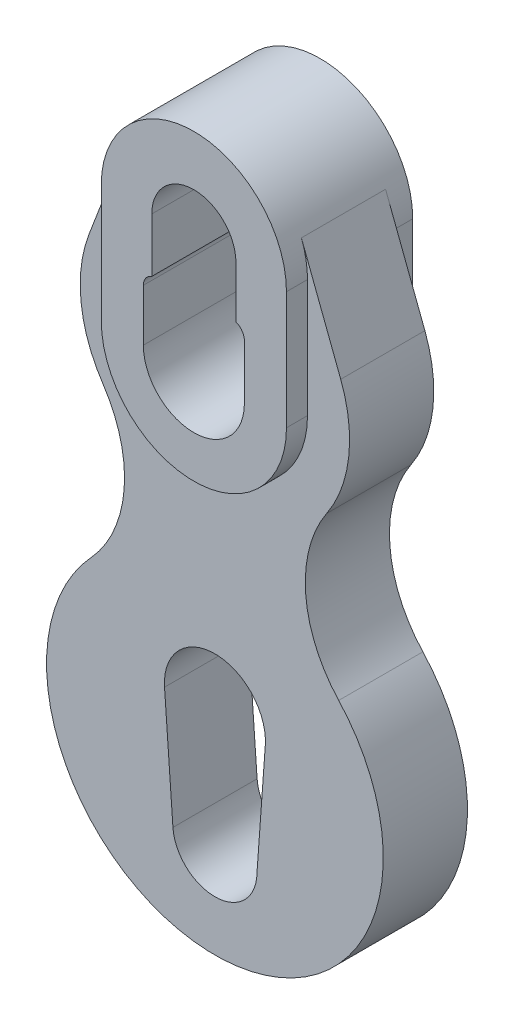
ISO-10303-21;
HEADER;
FILE_DESCRIPTION(('STEP AP214'),'2;1');
FILE_NAME('part.step','',(''),(''),'','','');
FILE_SCHEMA(('AUTOMOTIVE_DESIGN { 1 0 10303 214 1 1 1 1 }'));
ENDSEC;
DATA;
#1=APPLICATION_CONTEXT('core data for automotive mechanical design processes');
#2=APPLICATION_PROTOCOL_DEFINITION('international standard','automotive_design',2000,#1);
#3=PRODUCT_CONTEXT('',#1,'mechanical');
#4=PRODUCT('Part','Part','',(#3));
#5=PRODUCT_RELATED_PRODUCT_CATEGORY('part','',(#4));
#6=PRODUCT_DEFINITION_FORMATION('','',#4);
#7=PRODUCT_DEFINITION_CONTEXT('part definition',#1,'design');
#8=PRODUCT_DEFINITION('design','',#6,#7);
#9=PRODUCT_DEFINITION_SHAPE('','',#8);
#10=(LENGTH_UNIT() NAMED_UNIT(*) SI_UNIT(.MILLI.,.METRE.));
#11=(NAMED_UNIT(*) PLANE_ANGLE_UNIT() SI_UNIT($,.RADIAN.));
#12=(NAMED_UNIT(*) SI_UNIT($,.STERADIAN.) SOLID_ANGLE_UNIT());
#13=UNCERTAINTY_MEASURE_WITH_UNIT(LENGTH_MEASURE(1.E-05),#10,'distance_accuracy_value','');
#14=(GEOMETRIC_REPRESENTATION_CONTEXT(3) GLOBAL_UNCERTAINTY_ASSIGNED_CONTEXT((#13)) GLOBAL_UNIT_ASSIGNED_CONTEXT((#10,
#11,#12)) REPRESENTATION_CONTEXT('',''));
#15=CARTESIAN_POINT('',(0.,0.,0.));
#16=DIRECTION('',(0.,0.,1.));
#17=DIRECTION('',(1.,0.,0.));
#18=AXIS2_PLACEMENT_3D('',#15,#16,#17);
#19=CARTESIAN_POINT('',(-22.,0.,15.));
#20=DIRECTION('',(1.,0.,0.));
#21=DIRECTION('',(0.,1.,0.));
#22=AXIS2_PLACEMENT_3D('',#19,#20,#21);
#23=PLANE('',#22);
#24=DIRECTION('',(0.,-1.,0.));
#25=VECTOR('',#24,1.);
#26=CARTESIAN_POINT('',(-22.,0.,-10.));
#27=LINE('',#26,#25);
#28=CARTESIAN_POINT('',(-22.,110.,-10.));
#29=VERTEX_POINT('',#28);
#30=CARTESIAN_POINT('',(-22.,82.,-10.));
#31=VERTEX_POINT('',#30);
#32=EDGE_CURVE('E299',#29,#31,#27,.T.);
#33=ORIENTED_EDGE('',*,*,#32,.F.);
#34=DIRECTION('',(0.,0.,-1.));
#35=VECTOR('',#34,1.);
#36=CARTESIAN_POINT('',(-22.,110.,15.));
#37=LINE('',#36,#35);
#38=CARTESIAN_POINT('',(-22.,110.,-15.));
#39=VERTEX_POINT('',#38);
#40=EDGE_CURVE('E374',#29,#39,#37,.T.);
#41=ORIENTED_EDGE('',*,*,#40,.T.);
#42=DIRECTION('',(0.,-1.,0.));
#43=VECTOR('',#42,1.);
#44=CARTESIAN_POINT('',(-22.,0.,-15.));
#45=LINE('',#44,#43);
#46=CARTESIAN_POINT('',(-22.,82.,-15.));
#47=VERTEX_POINT('',#46);
#48=EDGE_CURVE('E324',#39,#47,#45,.T.);
#49=ORIENTED_EDGE('',*,*,#48,.T.);
#50=DIRECTION('',(0.,0.,-1.));
#51=VECTOR('',#50,1.);
#52=CARTESIAN_POINT('',(-22.,82.,15.));
#53=LINE('',#52,#51);
#54=EDGE_CURVE('E430',#31,#47,#53,.T.);
#55=ORIENTED_EDGE('',*,*,#54,.F.);
#56=EDGE_LOOP('',(#33,#41,#49,#55));
#57=FACE_BOUND('',#56,.T.);
#58=ADVANCED_FACE('F35',(#57),#23,.F.);
#59=CARTESIAN_POINT('',(0.,82.,15.));
#60=DIRECTION('',(0.,0.,-1.));
#61=DIRECTION('',(-1.,0.,0.));
#62=AXIS2_PLACEMENT_3D('',#59,#60,#61);
#63=CYLINDRICAL_SURFACE('',#62,22.);
#64=CARTESIAN_POINT('',(0.,82.,-10.));
#65=DIRECTION('',(0.,0.,1.));
#66=DIRECTION('',(1.,0.,0.));
#67=AXIS2_PLACEMENT_3D('',#64,#65,#66);
#68=CIRCLE('',#67,22.);
#69=CARTESIAN_POINT('',(22.,82.,-10.));
#70=VERTEX_POINT('',#69);
#71=EDGE_CURVE('E52',#31,#70,#68,.T.);
#72=ORIENTED_EDGE('',*,*,#71,.F.);
#73=ORIENTED_EDGE('',*,*,#54,.T.);
#74=CARTESIAN_POINT('',(0.,82.,-15.));
#75=DIRECTION('',(0.,0.,1.));
#76=DIRECTION('',(1.,0.,0.));
#77=AXIS2_PLACEMENT_3D('',#74,#75,#76);
#78=CIRCLE('',#77,22.);
#79=CARTESIAN_POINT('',(22.,82.,-15.));
#80=VERTEX_POINT('',#79);
#81=EDGE_CURVE('E377',#47,#80,#78,.T.);
#82=ORIENTED_EDGE('',*,*,#81,.T.);
#83=DIRECTION('',(0.,0.,-1.));
#84=VECTOR('',#83,1.);
#85=CARTESIAN_POINT('',(22.,82.,15.));
#86=LINE('',#85,#84);
#87=EDGE_CURVE('E427',#70,#80,#86,.T.);
#88=ORIENTED_EDGE('',*,*,#87,.F.);
#89=EDGE_LOOP('',(#72,#73,#82,#88));
#90=FACE_BOUND('',#89,.T.);
#91=ADVANCED_FACE('F439',(#90),#63,.T.);
#92=CARTESIAN_POINT('',(22.,0.,15.));
#93=DIRECTION('',(1.,0.,0.));
#94=DIRECTION('',(0.,1.,0.));
#95=AXIS2_PLACEMENT_3D('',#92,#93,#94);
#96=PLANE('',#95);
#97=DIRECTION('',(0.,0.,-1.));
#98=VECTOR('',#97,1.);
#99=CARTESIAN_POINT('',(22.,110.,15.));
#100=LINE('',#99,#98);
#101=CARTESIAN_POINT('',(22.,110.,-10.));
#102=VERTEX_POINT('',#101);
#103=CARTESIAN_POINT('',(22.,110.,-15.));
#104=VERTEX_POINT('',#103);
#105=EDGE_CURVE('E424',#102,#104,#100,.T.);
#106=ORIENTED_EDGE('',*,*,#105,.F.);
#107=DIRECTION('',(0.,-1.,0.));
#108=VECTOR('',#107,1.);
#109=CARTESIAN_POINT('',(22.,0.,-10.));
#110=LINE('',#109,#108);
#111=EDGE_CURVE('E295',#102,#70,#110,.T.);
#112=ORIENTED_EDGE('',*,*,#111,.T.);
#113=ORIENTED_EDGE('',*,*,#87,.T.);
#114=DIRECTION('',(0.,-1.,0.));
#115=VECTOR('',#114,1.);
#116=CARTESIAN_POINT('',(22.,0.,-15.));
#117=LINE('',#116,#115);
#118=EDGE_CURVE('E380',#104,#80,#117,.T.);
#119=ORIENTED_EDGE('',*,*,#118,.F.);
#120=EDGE_LOOP('',(#106,#112,#113,#119));
#121=FACE_BOUND('',#120,.T.);
#122=ADVANCED_FACE('F436',(#121),#96,.T.);
#123=CARTESIAN_POINT('',(9.99999999999998,0.,15.));
#124=DIRECTION('',(1.,0.,0.));
#125=DIRECTION('',(0.,1.,0.));
#126=AXIS2_PLACEMENT_3D('',#123,#124,#125);
#127=PLANE('',#126);
#128=DIRECTION('',(0.,-1.,0.));
#129=VECTOR('',#128,1.);
#130=CARTESIAN_POINT('',(9.99999999999998,0.,-15.));
#131=LINE('',#130,#129);
#132=CARTESIAN_POINT('',(10.,110.,-15.));
#133=VERTEX_POINT('',#132);
#134=CARTESIAN_POINT('',(10.,97.7630843631491,-15.));
#135=VERTEX_POINT('',#134);
#136=EDGE_CURVE('E386',#133,#135,#131,.T.);
#137=ORIENTED_EDGE('',*,*,#136,.T.);
#138=DIRECTION('',(0.,0.,-1.));
#139=VECTOR('',#138,1.);
#140=CARTESIAN_POINT('',(10.,97.7630843631491,15.));
#141=LINE('',#140,#139);
#142=CARTESIAN_POINT('',(10.,97.7630843631491,15.));
#143=VERTEX_POINT('',#142);
#144=EDGE_CURVE('E11',#143,#135,#141,.T.);
#145=ORIENTED_EDGE('',*,*,#144,.F.);
#146=DIRECTION('',(0.,-1.,0.));
#147=VECTOR('',#146,1.);
#148=CARTESIAN_POINT('',(9.99999999999998,0.,15.));
#149=LINE('',#148,#147);
#150=CARTESIAN_POINT('',(10.,110.,15.));
#151=VERTEX_POINT('',#150);
#152=EDGE_CURVE('E352',#151,#143,#149,.T.);
#153=ORIENTED_EDGE('',*,*,#152,.F.);
#154=DIRECTION('',(0.,0.,-1.));
#155=VECTOR('',#154,1.);
#156=CARTESIAN_POINT('',(10.,110.,15.));
#157=LINE('',#156,#155);
#158=EDGE_CURVE('E408',#151,#133,#157,.T.);
#159=ORIENTED_EDGE('',*,*,#158,.T.);
#160=EDGE_LOOP('',(#137,#145,#153,#159));
#161=FACE_BOUND('',#160,.T.);
#162=ADVANCED_FACE('F541',(#161),#127,.F.);
#163=CARTESIAN_POINT('',(9.00000000000001,94.9346572384029,15.));
#164=DIRECTION('',(0.,0.,-1.));
#165=DIRECTION('',(-1.,0.,0.));
#166=AXIS2_PLACEMENT_3D('',#163,#164,#165);
#167=CYLINDRICAL_SURFACE('',#166,3.);
#168=CARTESIAN_POINT('',(9.00000000000001,94.9346572384029,-15.));
#169=DIRECTION('',(0.,0.,1.));
#170=DIRECTION('',(1.,0.,0.));
#171=AXIS2_PLACEMENT_3D('',#168,#169,#170);
#172=CIRCLE('',#171,3.);
#173=CARTESIAN_POINT('',(12.,94.9346572384029,-15.));
#174=VERTEX_POINT('',#173);
#175=EDGE_CURVE('E389',#135,#174,#172,.F.);
#176=ORIENTED_EDGE('',*,*,#175,.T.);
#177=DIRECTION('',(0.,0.,-1.));
#178=VECTOR('',#177,1.);
#179=CARTESIAN_POINT('',(12.,94.9346572384029,15.));
#180=LINE('',#179,#178);
#181=CARTESIAN_POINT('',(12.,94.9346572384029,15.));
#182=VERTEX_POINT('',#181);
#183=EDGE_CURVE('E44',#182,#174,#180,.T.);
#184=ORIENTED_EDGE('',*,*,#183,.F.);
#185=CARTESIAN_POINT('',(9.00000000000001,94.9346572384029,15.));
#186=DIRECTION('',(0.,0.,1.));
#187=DIRECTION('',(1.,0.,0.));
#188=AXIS2_PLACEMENT_3D('',#185,#186,#187);
#189=CIRCLE('',#188,3.);
#190=EDGE_CURVE('E355',#143,#182,#189,.F.);
#191=ORIENTED_EDGE('',*,*,#190,.F.);
#192=ORIENTED_EDGE('',*,*,#144,.T.);
#193=EDGE_LOOP('',(#176,#184,#191,#192));
#194=FACE_BOUND('',#193,.T.);
#195=ADVANCED_FACE('F537',(#194),#167,.F.);
#196=CARTESIAN_POINT('',(12.0000000000001,0.,15.));
#197=DIRECTION('',(1.,0.,0.));
#198=DIRECTION('',(0.,1.,0.));
#199=AXIS2_PLACEMENT_3D('',#196,#197,#198);
#200=PLANE('',#199);
#201=DIRECTION('',(0.,-1.,0.));
#202=VECTOR('',#201,1.);
#203=CARTESIAN_POINT('',(12.0000000000001,0.,-15.));
#204=LINE('',#203,#202);
#205=CARTESIAN_POINT('',(12.,82.,-15.));
#206=VERTEX_POINT('',#205);
#207=EDGE_CURVE('E391',#174,#206,#204,.T.);
#208=ORIENTED_EDGE('',*,*,#207,.T.);
#209=DIRECTION('',(0.,0.,-1.));
#210=VECTOR('',#209,1.);
#211=CARTESIAN_POINT('',(12.,82.,15.));
#212=LINE('',#211,#210);
#213=CARTESIAN_POINT('',(12.,82.,15.));
#214=VERTEX_POINT('',#213);
#215=EDGE_CURVE('E418',#214,#206,#212,.T.);
#216=ORIENTED_EDGE('',*,*,#215,.F.);
#217=DIRECTION('',(0.,-1.,0.));
#218=VECTOR('',#217,1.);
#219=CARTESIAN_POINT('',(12.0000000000001,0.,15.));
#220=LINE('',#219,#218);
#221=EDGE_CURVE('E357',#182,#214,#220,.T.);
#222=ORIENTED_EDGE('',*,*,#221,.F.);
#223=ORIENTED_EDGE('',*,*,#183,.T.);
#224=EDGE_LOOP('',(#208,#216,#222,#223));
#225=FACE_BOUND('',#224,.T.);
#226=ADVANCED_FACE('F533',(#225),#200,.F.);
#227=CARTESIAN_POINT('',(0.,82.,15.));
#228=DIRECTION('',(0.,0.,-1.));
#229=DIRECTION('',(-1.,0.,0.));
#230=AXIS2_PLACEMENT_3D('',#227,#228,#229);
#231=CYLINDRICAL_SURFACE('',#230,12.0000000000003);
#232=CARTESIAN_POINT('',(0.,82.,-15.));
#233=DIRECTION('',(0.,0.,1.));
#234=DIRECTION('',(1.,0.,0.));
#235=AXIS2_PLACEMENT_3D('',#232,#233,#234);
#236=CIRCLE('',#235,12.0000000000003);
#237=CARTESIAN_POINT('',(-12.0000000000006,81.9999999999999,-15.));
#238=VERTEX_POINT('',#237);
#239=EDGE_CURVE('E394',#238,#206,#236,.T.);
#240=ORIENTED_EDGE('',*,*,#239,.F.);
#241=DIRECTION('',(0.,0.,-1.));
#242=VECTOR('',#241,1.);
#243=CARTESIAN_POINT('',(-12.0000000000006,81.9999999999999,15.));
#244=LINE('',#243,#242);
#245=CARTESIAN_POINT('',(-12.0000000000006,81.9999999999999,15.));
#246=VERTEX_POINT('',#245);
#247=EDGE_CURVE('E416',#246,#238,#244,.T.);
#248=ORIENTED_EDGE('',*,*,#247,.F.);
#249=CARTESIAN_POINT('',(0.,82.,15.));
#250=DIRECTION('',(0.,0.,1.));
#251=DIRECTION('',(1.,0.,0.));
#252=AXIS2_PLACEMENT_3D('',#249,#250,#251);
#253=CIRCLE('',#252,12.0000000000003);
#254=EDGE_CURVE('E359',#246,#214,#253,.T.);
#255=ORIENTED_EDGE('',*,*,#254,.T.);
#256=ORIENTED_EDGE('',*,*,#215,.T.);
#257=EDGE_LOOP('',(#240,#248,#255,#256));
#258=FACE_BOUND('',#257,.T.);
#259=ADVANCED_FACE('F529',(#258),#231,.F.);
#260=CARTESIAN_POINT('',(-12.0000000000044,5.54110435051287E-13,15.));
#261=DIRECTION('',(1.,0.,0.));
#262=DIRECTION('',(0.,1.,0.));
#263=AXIS2_PLACEMENT_3D('',#260,#261,#262);
#264=PLANE('',#263);
#265=DIRECTION('',(0.,-1.,0.));
#266=VECTOR('',#265,1.);
#267=CARTESIAN_POINT('',(-12.0000000000044,5.54110435051287E-13,-15.));
#268=LINE('',#267,#266);
#269=CARTESIAN_POINT('',(-12.,94.3222216539112,-15.));
#270=VERTEX_POINT('',#269);
#271=EDGE_CURVE('E397',#270,#238,#268,.T.);
#272=ORIENTED_EDGE('',*,*,#271,.F.);
#273=DIRECTION('',(0.,0.,-1.));
#274=VECTOR('',#273,1.);
#275=CARTESIAN_POINT('',(-12.,94.3222216539112,15.));
#276=LINE('',#275,#274);
#277=CARTESIAN_POINT('',(-12.,94.3222216539112,15.));
#278=VERTEX_POINT('',#277);
#279=EDGE_CURVE('E414',#278,#270,#276,.T.);
#280=ORIENTED_EDGE('',*,*,#279,.F.);
#281=DIRECTION('',(0.,-1.,0.));
#282=VECTOR('',#281,1.);
#283=CARTESIAN_POINT('',(-12.0000000000044,5.54110435051287E-13,15.));
#284=LINE('',#283,#282);
#285=EDGE_CURVE('E362',#278,#246,#284,.T.);
#286=ORIENTED_EDGE('',*,*,#285,.T.);
#287=ORIENTED_EDGE('',*,*,#247,.T.);
#288=EDGE_LOOP('',(#272,#280,#286,#287));
#289=FACE_BOUND('',#288,.T.);
#290=ADVANCED_FACE('F525',(#289),#264,.T.);
#291=CARTESIAN_POINT('',(-9.00000000000001,94.3222216539112,15.));
#292=DIRECTION('',(0.,0.,-1.));
#293=DIRECTION('',(-1.,0.,0.));
#294=AXIS2_PLACEMENT_3D('',#291,#292,#293);
#295=CYLINDRICAL_SURFACE('',#294,3.);
#296=CARTESIAN_POINT('',(-9.00000000000001,94.3222216539112,-15.));
#297=DIRECTION('',(0.,0.,1.));
#298=DIRECTION('',(1.,0.,0.));
#299=AXIS2_PLACEMENT_3D('',#296,#297,#298);
#300=CIRCLE('',#299,3.);
#301=CARTESIAN_POINT('',(-10.,97.1506487786574,-15.));
#302=VERTEX_POINT('',#301);
#303=EDGE_CURVE('E400',#302,#270,#300,.T.);
#304=ORIENTED_EDGE('',*,*,#303,.F.);
#305=DIRECTION('',(0.,0.,-1.));
#306=VECTOR('',#305,1.);
#307=CARTESIAN_POINT('',(-10.,97.1506487786574,15.));
#308=LINE('',#307,#306);
#309=CARTESIAN_POINT('',(-10.,97.1506487786574,15.));
#310=VERTEX_POINT('',#309);
#311=EDGE_CURVE('E412',#310,#302,#308,.T.);
#312=ORIENTED_EDGE('',*,*,#311,.F.);
#313=CARTESIAN_POINT('',(-9.00000000000001,94.3222216539112,15.));
#314=DIRECTION('',(0.,0.,1.));
#315=DIRECTION('',(1.,0.,0.));
#316=AXIS2_PLACEMENT_3D('',#313,#314,#315);
#317=CIRCLE('',#316,3.);
#318=EDGE_CURVE('E365',#310,#278,#317,.T.);
#319=ORIENTED_EDGE('',*,*,#318,.T.);
#320=ORIENTED_EDGE('',*,*,#279,.T.);
#321=EDGE_LOOP('',(#304,#312,#319,#320));
#322=FACE_BOUND('',#321,.T.);
#323=ADVANCED_FACE('F467',(#322),#295,.F.);
#324=CARTESIAN_POINT('',(-9.99999999999423,-5.94020909134747E-13,15.));
#325=DIRECTION('',(1.,0.,0.));
#326=DIRECTION('',(0.,1.,0.));
#327=AXIS2_PLACEMENT_3D('',#324,#325,#326);
#328=PLANE('',#327);
#329=DIRECTION('',(0.,-1.,0.));
#330=VECTOR('',#329,1.);
#331=CARTESIAN_POINT('',(-9.99999999999423,-5.94020909134747E-13,-15.));
#332=LINE('',#331,#330);
#333=CARTESIAN_POINT('',(-10.0000000000008,110.,-15.));
#334=VERTEX_POINT('',#333);
#335=EDGE_CURVE('E403',#334,#302,#332,.T.);
#336=ORIENTED_EDGE('',*,*,#335,.F.);
#337=DIRECTION('',(0.,0.,-1.));
#338=VECTOR('',#337,1.);
#339=CARTESIAN_POINT('',(-10.0000000000008,110.,15.));
#340=LINE('',#339,#338);
#341=CARTESIAN_POINT('',(-10.0000000000008,110.,15.));
#342=VERTEX_POINT('',#341);
#343=EDGE_CURVE('E410',#342,#334,#340,.T.);
#344=ORIENTED_EDGE('',*,*,#343,.F.);
#345=DIRECTION('',(0.,-1.,0.));
#346=VECTOR('',#345,1.);
#347=CARTESIAN_POINT('',(-9.99999999999423,-5.94020909134747E-13,15.));
#348=LINE('',#347,#346);
#349=EDGE_CURVE('E368',#342,#310,#348,.T.);
#350=ORIENTED_EDGE('',*,*,#349,.T.);
#351=ORIENTED_EDGE('',*,*,#311,.T.);
#352=EDGE_LOOP('',(#336,#344,#350,#351));
#353=FACE_BOUND('',#352,.T.);
#354=ADVANCED_FACE('F460',(#353),#328,.T.);
#355=CARTESIAN_POINT('',(-22.,110.,15.));
#356=VERTEX_POINT('',#355);
#357=CARTESIAN_POINT('',(-22.,110.,10.));
#358=VERTEX_POINT('',#357);
#359=EDGE_CURVE('E422',#356,#358,#37,.T.);
#360=ORIENTED_EDGE('',*,*,#359,.T.);
#361=DIRECTION('',(0.,-1.,0.));
#362=VECTOR('',#361,1.);
#363=CARTESIAN_POINT('',(-22.,0.,10.));
#364=LINE('',#363,#362);
#365=CARTESIAN_POINT('',(-22.,82.,10.));
#366=VERTEX_POINT('',#365);
#367=EDGE_CURVE('E60',#358,#366,#364,.T.);
#368=ORIENTED_EDGE('',*,*,#367,.T.);
#369=CARTESIAN_POINT('',(-22.,82.,15.));
#370=VERTEX_POINT('',#369);
#371=EDGE_CURVE('E39',#370,#366,#53,.T.);
#372=ORIENTED_EDGE('',*,*,#371,.F.);
#373=DIRECTION('',(0.,-1.,0.));
#374=VECTOR('',#373,1.);
#375=CARTESIAN_POINT('',(-22.,0.,15.));
#376=LINE('',#375,#374);
#377=EDGE_CURVE('E341',#356,#370,#376,.T.);
#378=ORIENTED_EDGE('',*,*,#377,.F.);
#379=EDGE_LOOP('',(#360,#368,#372,#378));
#380=FACE_BOUND('',#379,.T.);
#381=ADVANCED_FACE('F37',(#380),#23,.F.);
#382=ORIENTED_EDGE('',*,*,#371,.T.);
#383=CARTESIAN_POINT('',(0.,82.,10.));
#384=DIRECTION('',(0.,0.,1.));
#385=DIRECTION('',(1.,0.,0.));
#386=AXIS2_PLACEMENT_3D('',#383,#384,#385);
#387=CIRCLE('',#386,22.);
#388=CARTESIAN_POINT('',(22.,82.,10.));
#389=VERTEX_POINT('',#388);
#390=EDGE_CURVE('E265',#366,#389,#387,.T.);
#391=ORIENTED_EDGE('',*,*,#390,.T.);
#392=CARTESIAN_POINT('',(22.,82.,15.));
#393=VERTEX_POINT('',#392);
#394=EDGE_CURVE('E428',#393,#389,#86,.T.);
#395=ORIENTED_EDGE('',*,*,#394,.F.);
#396=CARTESIAN_POINT('',(0.,82.,15.));
#397=DIRECTION('',(0.,0.,1.));
#398=DIRECTION('',(1.,0.,0.));
#399=AXIS2_PLACEMENT_3D('',#396,#397,#398);
#400=CIRCLE('',#399,22.);
#401=EDGE_CURVE('E344',#370,#393,#400,.T.);
#402=ORIENTED_EDGE('',*,*,#401,.F.);
#403=EDGE_LOOP('',(#382,#391,#395,#402));
#404=FACE_BOUND('',#403,.T.);
#405=ADVANCED_FACE('F458',(#404),#63,.T.);
#406=DIRECTION('',(0.,-1.,0.));
#407=VECTOR('',#406,1.);
#408=CARTESIAN_POINT('',(22.,0.,10.));
#409=LINE('',#408,#407);
#410=CARTESIAN_POINT('',(22.,110.,10.));
#411=VERTEX_POINT('',#410);
#412=EDGE_CURVE('E261',#411,#389,#409,.T.);
#413=ORIENTED_EDGE('',*,*,#412,.F.);
#414=CARTESIAN_POINT('',(22.,110.,15.));
#415=VERTEX_POINT('',#414);
#416=EDGE_CURVE('E425',#415,#411,#100,.T.);
#417=ORIENTED_EDGE('',*,*,#416,.F.);
#418=DIRECTION('',(0.,-1.,0.));
#419=VECTOR('',#418,1.);
#420=CARTESIAN_POINT('',(22.,0.,15.));
#421=LINE('',#420,#419);
#422=EDGE_CURVE('E347',#415,#393,#421,.T.);
#423=ORIENTED_EDGE('',*,*,#422,.T.);
#424=ORIENTED_EDGE('',*,*,#394,.T.);
#425=EDGE_LOOP('',(#413,#417,#423,#424));
#426=FACE_BOUND('',#425,.T.);
#427=ADVANCED_FACE('F465',(#426),#96,.T.);
#428=CARTESIAN_POINT('',(0.,110.,15.));
#429=DIRECTION('',(0.,0.,-1.));
#430=DIRECTION('',(-1.,0.,0.));
#431=AXIS2_PLACEMENT_3D('',#428,#429,#430);
#432=CYLINDRICAL_SURFACE('',#431,22.);
#433=ORIENTED_EDGE('',*,*,#416,.T.);
#434=CARTESIAN_POINT('',(0.,110.,10.));
#435=DIRECTION('',(0.,0.,1.));
#436=DIRECTION('',(1.,0.,0.));
#437=AXIS2_PLACEMENT_3D('',#434,#435,#436);
#438=CIRCLE('',#437,22.);
#439=CARTESIAN_POINT('',(20.5490950195489,117.857142857143,10.));
#440=VERTEX_POINT('',#439);
#441=EDGE_CURVE('E259',#411,#440,#438,.T.);
#442=ORIENTED_EDGE('',*,*,#441,.T.);
#443=DIRECTION('',(0.,0.,-1.));
#444=VECTOR('',#443,1.);
#445=CARTESIAN_POINT('',(20.5490950195489,117.857142857143,10.));
#446=LINE('',#445,#444);
#447=CARTESIAN_POINT('',(20.5490950195489,117.857142857143,-10.));
#448=VERTEX_POINT('',#447);
#449=EDGE_CURVE('E338',#440,#448,#446,.T.);
#450=ORIENTED_EDGE('',*,*,#449,.T.);
#451=CARTESIAN_POINT('',(0.,110.,-10.));
#452=DIRECTION('',(0.,0.,1.));
#453=DIRECTION('',(1.,0.,0.));
#454=AXIS2_PLACEMENT_3D('',#451,#452,#453);
#455=CIRCLE('',#454,22.);
#456=EDGE_CURVE('E292',#102,#448,#455,.T.);
#457=ORIENTED_EDGE('',*,*,#456,.F.);
#458=ORIENTED_EDGE('',*,*,#105,.T.);
#459=CARTESIAN_POINT('',(0.,110.,-15.));
#460=DIRECTION('',(0.,0.,1.));
#461=DIRECTION('',(1.,0.,0.));
#462=AXIS2_PLACEMENT_3D('',#459,#460,#461);
#463=CIRCLE('',#462,22.);
#464=EDGE_CURVE('E383',#104,#39,#463,.T.);
#465=ORIENTED_EDGE('',*,*,#464,.T.);
#466=ORIENTED_EDGE('',*,*,#40,.F.);
#467=CARTESIAN_POINT('',(-20.5490950195497,117.857142857143,-10.));
#468=VERTEX_POINT('',#467);
#469=EDGE_CURVE('E296',#468,#29,#455,.T.);
#470=ORIENTED_EDGE('',*,*,#469,.F.);
#471=DIRECTION('',(0.,0.,-1.));
#472=VECTOR('',#471,1.);
#473=CARTESIAN_POINT('',(-20.5490950195497,117.857142857143,10.));
#474=LINE('',#473,#472);
#475=CARTESIAN_POINT('',(-20.5490950195494,117.857142857142,10.));
#476=VERTEX_POINT('',#475);
#477=EDGE_CURVE('E335',#476,#468,#474,.T.);
#478=ORIENTED_EDGE('',*,*,#477,.F.);
#479=EDGE_CURVE('E262',#476,#358,#438,.T.);
#480=ORIENTED_EDGE('',*,*,#479,.T.);
#481=ORIENTED_EDGE('',*,*,#359,.F.);
#482=CARTESIAN_POINT('',(0.,110.,15.));
#483=DIRECTION('',(0.,0.,1.));
#484=DIRECTION('',(1.,0.,0.));
#485=AXIS2_PLACEMENT_3D('',#482,#483,#484);
#486=CIRCLE('',#485,22.);
#487=EDGE_CURVE('E350',#415,#356,#486,.T.);
#488=ORIENTED_EDGE('',*,*,#487,.F.);
#489=EDGE_LOOP('',(#433,#442,#450,#457,#458,#465,#466,#470,#478,#480,#481,#488));
#490=FACE_BOUND('',#489,.T.);
#491=ADVANCED_FACE('F446',(#490),#432,.T.);
#492=CARTESIAN_POINT('',(0.,110.,15.));
#493=DIRECTION('',(0.,0.,-1.));
#494=DIRECTION('',(-1.,0.,0.));
#495=AXIS2_PLACEMENT_3D('',#492,#493,#494);
#496=CYLINDRICAL_SURFACE('',#495,10.0000000000004);
#497=CARTESIAN_POINT('',(0.,110.,-15.));
#498=DIRECTION('',(0.,0.,1.));
#499=DIRECTION('',(1.,0.,0.));
#500=AXIS2_PLACEMENT_3D('',#497,#498,#499);
#501=CIRCLE('',#500,10.0000000000004);
#502=EDGE_CURVE('E345',#133,#334,#501,.T.);
#503=ORIENTED_EDGE('',*,*,#502,.F.);
#504=ORIENTED_EDGE('',*,*,#158,.F.);
#505=CARTESIAN_POINT('',(0.,110.,15.));
#506=DIRECTION('',(0.,0.,1.));
#507=DIRECTION('',(1.,0.,0.));
#508=AXIS2_PLACEMENT_3D('',#505,#506,#507);
#509=CIRCLE('',#508,10.0000000000004);
#510=EDGE_CURVE('E371',#151,#342,#509,.T.);
#511=ORIENTED_EDGE('',*,*,#510,.T.);
#512=ORIENTED_EDGE('',*,*,#343,.T.);
#513=EDGE_LOOP('',(#503,#504,#511,#512));
#514=FACE_BOUND('',#513,.T.);
#515=ADVANCED_FACE('F516',(#514),#496,.F.);
#516=CARTESIAN_POINT('',(0.,0.,15.));
#517=DIRECTION('',(0.,0.,1.));
#518=DIRECTION('',(1.,0.,0.));
#519=AXIS2_PLACEMENT_3D('',#516,#517,#518);
#520=PLANE('',#519);
#521=ORIENTED_EDGE('',*,*,#377,.T.);
#522=ORIENTED_EDGE('',*,*,#401,.T.);
#523=ORIENTED_EDGE('',*,*,#422,.F.);
#524=ORIENTED_EDGE('',*,*,#487,.T.);
#525=EDGE_LOOP('',(#521,#522,#523,#524));
#526=FACE_BOUND('',#525,.T.);
#527=ORIENTED_EDGE('',*,*,#152,.T.);
#528=ORIENTED_EDGE('',*,*,#190,.T.);
#529=ORIENTED_EDGE('',*,*,#221,.T.);
#530=ORIENTED_EDGE('',*,*,#254,.F.);
#531=ORIENTED_EDGE('',*,*,#285,.F.);
#532=ORIENTED_EDGE('',*,*,#318,.F.);
#533=ORIENTED_EDGE('',*,*,#349,.F.);
#534=ORIENTED_EDGE('',*,*,#510,.F.);
#535=EDGE_LOOP('',(#527,#528,#529,#530,#531,#532,#533,#534));
#536=FACE_BOUND('',#535,.T.);
#537=ADVANCED_FACE('F478',(#526,#536),#520,.T.);
#538=CARTESIAN_POINT('',(0.,0.,-15.));
#539=DIRECTION('',(0.,0.,1.));
#540=DIRECTION('',(1.,0.,0.));
#541=AXIS2_PLACEMENT_3D('',#538,#539,#540);
#542=PLANE('',#541);
#543=ORIENTED_EDGE('',*,*,#48,.F.);
#544=ORIENTED_EDGE('',*,*,#464,.F.);
#545=ORIENTED_EDGE('',*,*,#118,.T.);
#546=ORIENTED_EDGE('',*,*,#81,.F.);
#547=EDGE_LOOP('',(#543,#544,#545,#546));
#548=FACE_BOUND('',#547,.T.);
#549=ORIENTED_EDGE('',*,*,#136,.F.);
#550=ORIENTED_EDGE('',*,*,#502,.T.);
#551=ORIENTED_EDGE('',*,*,#335,.T.);
#552=ORIENTED_EDGE('',*,*,#303,.T.);
#553=ORIENTED_EDGE('',*,*,#271,.T.);
#554=ORIENTED_EDGE('',*,*,#239,.T.);
#555=ORIENTED_EDGE('',*,*,#207,.F.);
#556=ORIENTED_EDGE('',*,*,#175,.F.);
#557=EDGE_LOOP('',(#549,#550,#551,#552,#553,#554,#555,#556));
#558=FACE_BOUND('',#557,.T.);
#559=ADVANCED_FACE('F443',(#548,#558),#542,.F.);
#560=CARTESIAN_POINT('',(0.,10.,10.));
#561=DIRECTION('',(0.,0.,-1.));
#562=DIRECTION('',(-1.,0.,0.));
#563=AXIS2_PLACEMENT_3D('',#560,#561,#562);
#564=CYLINDRICAL_SURFACE('',#563,12.);
#565=CARTESIAN_POINT('',(0.,10.,-10.));
#566=DIRECTION('',(0.,0.,1.));
#567=DIRECTION('',(1.,0.,0.));
#568=AXIS2_PLACEMENT_3D('',#565,#566,#567);
#569=CIRCLE('',#568,12.);
#570=CARTESIAN_POINT('',(11.968538667274,9.13162095259786,-10.));
#571=VERTEX_POINT('',#570);
#572=CARTESIAN_POINT('',(-11.9693486089448,9.14285714285714,-10.));
#573=VERTEX_POINT('',#572);
#574=EDGE_CURVE('E309',#571,#573,#569,.T.);
#575=ORIENTED_EDGE('',*,*,#574,.F.);
#576=DIRECTION('',(0.,0.,-1.));
#577=VECTOR('',#576,1.);
#578=CARTESIAN_POINT('',(11.968538667274,9.13162095259786,10.));
#579=LINE('',#578,#577);
#580=CARTESIAN_POINT('',(11.968538667274,9.13162095259786,10.));
#581=VERTEX_POINT('',#580);
#582=EDGE_CURVE('E322',#581,#571,#579,.T.);
#583=ORIENTED_EDGE('',*,*,#582,.F.);
#584=CARTESIAN_POINT('',(0.,10.,10.));
#585=DIRECTION('',(0.,0.,1.));
#586=DIRECTION('',(1.,0.,0.));
#587=AXIS2_PLACEMENT_3D('',#584,#585,#586);
#588=CIRCLE('',#587,12.);
#589=CARTESIAN_POINT('',(-11.9693486089448,9.14285714285714,10.));
#590=VERTEX_POINT('',#589);
#591=EDGE_CURVE('E273',#581,#590,#588,.T.);
#592=ORIENTED_EDGE('',*,*,#591,.T.);
#593=DIRECTION('',(0.,0.,-1.));
#594=VECTOR('',#593,1.);
#595=CARTESIAN_POINT('',(-11.9693486089448,9.14285714285714,10.));
#596=LINE('',#595,#594);
#597=EDGE_CURVE('E235',#590,#573,#596,.T.);
#598=ORIENTED_EDGE('',*,*,#597,.T.);
#599=EDGE_LOOP('',(#575,#583,#592,#598));
#600=FACE_BOUND('',#599,.T.);
#601=ADVANCED_FACE('F519',(#600),#564,.F.);
#602=CARTESIAN_POINT('',(11.2467867084766,-0.816012230043319,10.));
#603=DIRECTION('',(0.997378222272834,-0.0723649206168452,0.));
#604=DIRECTION('',(0.0723649206168452,0.997378222272834,0.));
#605=AXIS2_PLACEMENT_3D('',#602,#603,#604);
#606=PLANE('',#605);
#607=DIRECTION('',(-0.0723649206168452,-0.997378222272834,0.));
#608=VECTOR('',#607,1.);
#609=CARTESIAN_POINT('',(11.2467867084766,-0.816012230043319,-10.));
#610=LINE('',#609,#608);
#611=CARTESIAN_POINT('',(10.,-18.,-10.));
#612=VERTEX_POINT('',#611);
#613=EDGE_CURVE('E312',#571,#612,#610,.T.);
#614=ORIENTED_EDGE('',*,*,#613,.T.);
#615=DIRECTION('',(0.,0.,-1.));
#616=VECTOR('',#615,1.);
#617=CARTESIAN_POINT('',(10.,-18.,10.));
#618=LINE('',#617,#616);
#619=CARTESIAN_POINT('',(10.,-18.,10.));
#620=VERTEX_POINT('',#619);
#621=EDGE_CURVE('E320',#620,#612,#618,.T.);
#622=ORIENTED_EDGE('',*,*,#621,.F.);
#623=DIRECTION('',(-0.0723649206168452,-0.997378222272834,0.));
#624=VECTOR('',#623,1.);
#625=CARTESIAN_POINT('',(11.2467867084766,-0.816012230043319,10.));
#626=LINE('',#625,#624);
#627=EDGE_CURVE('E276',#581,#620,#626,.T.);
#628=ORIENTED_EDGE('',*,*,#627,.F.);
#629=ORIENTED_EDGE('',*,*,#582,.T.);
#630=EDGE_LOOP('',(#614,#622,#628,#629));
#631=FACE_BOUND('',#630,.T.);
#632=ADVANCED_FACE('F624',(#631),#606,.F.);
#633=CARTESIAN_POINT('',(0.,-18.,10.));
#634=DIRECTION('',(0.,0.,-1.));
#635=DIRECTION('',(-1.,0.,0.));
#636=AXIS2_PLACEMENT_3D('',#633,#634,#635);
#637=CYLINDRICAL_SURFACE('',#636,10.);
#638=CARTESIAN_POINT('',(0.,-18.,-10.));
#639=DIRECTION('',(0.,0.,1.));
#640=DIRECTION('',(1.,0.,0.));
#641=AXIS2_PLACEMENT_3D('',#638,#639,#640);
#642=CIRCLE('',#641,10.);
#643=CARTESIAN_POINT('',(-9.97445717412068,-18.7142857142857,-10.));
#644=VERTEX_POINT('',#643);
#645=EDGE_CURVE('E255',#644,#612,#642,.T.);
#646=ORIENTED_EDGE('',*,*,#645,.F.);
#647=DIRECTION('',(0.,0.,-1.));
#648=VECTOR('',#647,1.);
#649=CARTESIAN_POINT('',(-9.97445717412068,-18.7142857142857,10.));
#650=LINE('',#649,#648);
#651=CARTESIAN_POINT('',(-9.97445717412068,-18.7142857142857,10.));
#652=VERTEX_POINT('',#651);
#653=EDGE_CURVE('E318',#652,#644,#650,.T.);
#654=ORIENTED_EDGE('',*,*,#653,.F.);
#655=CARTESIAN_POINT('',(0.,-18.,10.));
#656=DIRECTION('',(0.,0.,1.));
#657=DIRECTION('',(1.,0.,0.));
#658=AXIS2_PLACEMENT_3D('',#655,#656,#657);
#659=CIRCLE('',#658,10.);
#660=EDGE_CURVE('E278',#652,#620,#659,.T.);
#661=ORIENTED_EDGE('',*,*,#660,.T.);
#662=ORIENTED_EDGE('',*,*,#621,.T.);
#663=EDGE_LOOP('',(#646,#654,#661,#662));
#664=FACE_BOUND('',#663,.T.);
#665=ADVANCED_FACE('F513',(#664),#637,.F.);
#666=CARTESIAN_POINT('',(51.4736725414249,47.4390243902439,10.));
#667=DIRECTION('',(0.,0.,-1.));
#668=DIRECTION('',(-1.,0.,0.));
#669=AXIS2_PLACEMENT_3D('',#666,#667,#668);
#670=CYLINDRICAL_SURFACE('',#669,30.);
#671=CARTESIAN_POINT('',(51.4736725414249,47.4390243902439,-10.));
#672=DIRECTION('',(0.,0.,1.));
#673=DIRECTION('',(1.,0.,0.));
#674=AXIS2_PLACEMENT_3D('',#671,#672,#673);
#675=CIRCLE('',#674,30.);
#676=CARTESIAN_POINT('',(26.5670567955742,64.162077104642,-10.));
#677=VERTEX_POINT('',#676);
#678=CARTESIAN_POINT('',(29.4135271665285,27.1080139372822,-10.));
#679=VERTEX_POINT('',#678);
#680=EDGE_CURVE('E231',#677,#679,#675,.T.);
#681=ORIENTED_EDGE('',*,*,#680,.F.);
#682=DIRECTION('',(0.,0.,-1.));
#683=VECTOR('',#682,1.);
#684=CARTESIAN_POINT('',(26.5670567955742,64.162077104642,10.));
#685=LINE('',#684,#683);
#686=CARTESIAN_POINT('',(26.5670567955742,64.162077104642,10.));
#687=VERTEX_POINT('',#686);
#688=EDGE_CURVE('E225',#687,#677,#685,.T.);
#689=ORIENTED_EDGE('',*,*,#688,.F.);
#690=CARTESIAN_POINT('',(51.4736725414249,47.4390243902439,10.));
#691=DIRECTION('',(0.,0.,1.));
#692=DIRECTION('',(1.,0.,0.));
#693=AXIS2_PLACEMENT_3D('',#690,#691,#692);
#694=CIRCLE('',#693,30.);
#695=CARTESIAN_POINT('',(29.4135271665285,27.1080139372822,10.));
#696=VERTEX_POINT('',#695);
#697=EDGE_CURVE('E229',#687,#696,#694,.T.);
#698=ORIENTED_EDGE('',*,*,#697,.T.);
#699=DIRECTION('',(0.,0.,-1.));
#700=VECTOR('',#699,1.);
#701=CARTESIAN_POINT('',(29.4135271665285,27.1080139372822,10.));
#702=LINE('',#701,#700);
#703=EDGE_CURVE('E284',#696,#679,#702,.T.);
#704=ORIENTED_EDGE('',*,*,#703,.T.);
#705=EDGE_LOOP('',(#681,#689,#698,#704));
#706=FACE_BOUND('',#705,.T.);
#707=ADVANCED_FACE('F227',(#706),#670,.F.);
#708=CARTESIAN_POINT('',(0.,82.,10.));
#709=DIRECTION('',(0.,0.,-1.));
#710=DIRECTION('',(-1.,0.,0.));
#711=AXIS2_PLACEMENT_3D('',#708,#709,#710);
#712=CYLINDRICAL_SURFACE('',#711,32.);
#713=CARTESIAN_POINT('',(0.,82.,-10.));
#714=DIRECTION('',(0.,0.,1.));
#715=DIRECTION('',(1.,0.,0.));
#716=AXIS2_PLACEMENT_3D('',#713,#714,#715);
#717=CIRCLE('',#716,32.);
#718=CARTESIAN_POINT('',(29.8895927557075,93.4285714285714,-10.));
#719=VERTEX_POINT('',#718);
#720=EDGE_CURVE('E286',#677,#719,#717,.T.);
#721=ORIENTED_EDGE('',*,*,#720,.T.);
#722=DIRECTION('',(0.,0.,-1.));
#723=VECTOR('',#722,1.);
#724=CARTESIAN_POINT('',(29.8895927557075,93.4285714285714,10.));
#725=LINE('',#724,#723);
#726=CARTESIAN_POINT('',(29.8895927557075,93.4285714285714,10.));
#727=VERTEX_POINT('',#726);
#728=EDGE_CURVE('E236',#727,#719,#725,.T.);
#729=ORIENTED_EDGE('',*,*,#728,.F.);
#730=CARTESIAN_POINT('',(0.,82.,10.));
#731=DIRECTION('',(0.,0.,1.));
#732=DIRECTION('',(1.,0.,0.));
#733=AXIS2_PLACEMENT_3D('',#730,#731,#732);
#734=CIRCLE('',#733,32.);
#735=EDGE_CURVE('E239',#687,#727,#734,.T.);
#736=ORIENTED_EDGE('',*,*,#735,.F.);
#737=ORIENTED_EDGE('',*,*,#688,.T.);
#738=EDGE_LOOP('',(#721,#729,#736,#737));
#739=FACE_BOUND('',#738,.T.);
#740=ADVANCED_FACE('F240',(#739),#712,.T.);
#741=CARTESIAN_POINT('',(57.2439075544576,21.8877551020408,10.));
#742=DIRECTION('',(0.934049773615859,0.357142857142857,0.));
#743=DIRECTION('',(-0.357142857142857,0.934049773615859,0.));
#744=AXIS2_PLACEMENT_3D('',#741,#742,#743);
#745=PLANE('',#744);
#746=DIRECTION('',(0.357142857142857,-0.934049773615859,0.));
#747=VECTOR('',#746,1.);
#748=CARTESIAN_POINT('',(57.2439075544576,21.8877551020408,-10.));
#749=LINE('',#748,#747);
#750=EDGE_CURVE('E288',#448,#719,#749,.T.);
#751=ORIENTED_EDGE('',*,*,#750,.F.);
#752=ORIENTED_EDGE('',*,*,#449,.F.);
#753=DIRECTION('',(0.357142857142857,-0.934049773615859,0.));
#754=VECTOR('',#753,1.);
#755=CARTESIAN_POINT('',(57.2439075544576,21.8877551020408,10.));
#756=LINE('',#755,#754);
#757=EDGE_CURVE('E244',#440,#727,#756,.T.);
#758=ORIENTED_EDGE('',*,*,#757,.T.);
#759=ORIENTED_EDGE('',*,*,#728,.T.);
#760=EDGE_LOOP('',(#751,#752,#758,#759));
#761=FACE_BOUND('',#760,.T.);
#762=ADVANCED_FACE('F483',(#761),#745,.T.);
#763=CARTESIAN_POINT('',(-57.2439075544563,21.8877551020386,10.));
#764=DIRECTION('',(0.934049773615868,-0.357142857142833,0.));
#765=DIRECTION('',(0.357142857142833,0.934049773615868,0.));
#766=AXIS2_PLACEMENT_3D('',#763,#764,#765);
#767=PLANE('',#766);
#768=DIRECTION('',(-0.357142857142833,-0.934049773615868,0.));
#769=VECTOR('',#768,1.);
#770=CARTESIAN_POINT('',(-57.2439075544563,21.8877551020386,-10.));
#771=LINE('',#770,#769);
#772=CARTESIAN_POINT('',(-29.8895927557076,93.428571428571,-10.));
#773=VERTEX_POINT('',#772);
#774=EDGE_CURVE('E302',#468,#773,#771,.T.);
#775=ORIENTED_EDGE('',*,*,#774,.T.);
#776=DIRECTION('',(0.,0.,-1.));
#777=VECTOR('',#776,1.);
#778=CARTESIAN_POINT('',(-29.8895927557076,93.428571428571,10.));
#779=LINE('',#778,#777);
#780=CARTESIAN_POINT('',(-29.8895927557076,93.428571428571,10.));
#781=VERTEX_POINT('',#780);
#782=EDGE_CURVE('E332',#781,#773,#779,.T.);
#783=ORIENTED_EDGE('',*,*,#782,.F.);
#784=DIRECTION('',(-0.357142857142833,-0.934049773615868,0.));
#785=VECTOR('',#784,1.);
#786=CARTESIAN_POINT('',(-57.2439075544563,21.8877551020386,10.));
#787=LINE('',#786,#785);
#788=EDGE_CURVE('E268',#476,#781,#787,.T.);
#789=ORIENTED_EDGE('',*,*,#788,.F.);
#790=ORIENTED_EDGE('',*,*,#477,.T.);
#791=EDGE_LOOP('',(#775,#783,#789,#790));
#792=FACE_BOUND('',#791,.T.);
#793=ADVANCED_FACE('F499',(#792),#767,.F.);
#794=CARTESIAN_POINT('',(-26.5670567955744,64.162077104642,-10.));
#795=VERTEX_POINT('',#794);
#796=EDGE_CURVE('E289',#773,#795,#717,.T.);
#797=ORIENTED_EDGE('',*,*,#796,.T.);
#798=DIRECTION('',(0.,0.,-1.));
#799=VECTOR('',#798,1.);
#800=CARTESIAN_POINT('',(-26.5670567955744,64.162077104642,10.));
#801=LINE('',#800,#799);
#802=CARTESIAN_POINT('',(-26.5670567955744,64.162077104642,10.));
#803=VERTEX_POINT('',#802);
#804=EDGE_CURVE('E329',#803,#795,#801,.T.);
#805=ORIENTED_EDGE('',*,*,#804,.F.);
#806=EDGE_CURVE('E246',#781,#803,#734,.T.);
#807=ORIENTED_EDGE('',*,*,#806,.F.);
#808=ORIENTED_EDGE('',*,*,#782,.T.);
#809=EDGE_LOOP('',(#797,#805,#807,#808));
#810=FACE_BOUND('',#809,.T.);
#811=ADVANCED_FACE('F496',(#810),#712,.T.);
#812=CARTESIAN_POINT('',(-51.4736725414253,47.4390243902436,10.));
#813=DIRECTION('',(0.,0.,-1.));
#814=DIRECTION('',(-1.,0.,0.));
#815=AXIS2_PLACEMENT_3D('',#812,#813,#814);
#816=CYLINDRICAL_SURFACE('',#815,30.);
#817=CARTESIAN_POINT('',(-51.4736725414253,47.4390243902436,-10.));
#818=DIRECTION('',(0.,0.,1.));
#819=DIRECTION('',(1.,0.,0.));
#820=AXIS2_PLACEMENT_3D('',#817,#818,#819);
#821=CIRCLE('',#820,30.);
#822=CARTESIAN_POINT('',(-29.4135271665287,27.108013937282,-10.));
#823=VERTEX_POINT('',#822);
#824=EDGE_CURVE('E304',#795,#823,#821,.F.);
#825=ORIENTED_EDGE('',*,*,#824,.T.);
#826=DIRECTION('',(0.,0.,-1.));
#827=VECTOR('',#826,1.);
#828=CARTESIAN_POINT('',(-29.4135271665287,27.108013937282,10.));
#829=LINE('',#828,#827);
#830=CARTESIAN_POINT('',(-29.4135271665287,27.108013937282,10.));
#831=VERTEX_POINT('',#830);
#832=EDGE_CURVE('E326',#831,#823,#829,.T.);
#833=ORIENTED_EDGE('',*,*,#832,.F.);
#834=CARTESIAN_POINT('',(-51.4736725414253,47.4390243902436,10.));
#835=DIRECTION('',(0.,0.,1.));
#836=DIRECTION('',(1.,0.,0.));
#837=AXIS2_PLACEMENT_3D('',#834,#835,#836);
#838=CIRCLE('',#837,30.);
#839=EDGE_CURVE('E270',#803,#831,#838,.F.);
#840=ORIENTED_EDGE('',*,*,#839,.F.);
#841=ORIENTED_EDGE('',*,*,#804,.T.);
#842=EDGE_LOOP('',(#825,#833,#840,#841));
#843=FACE_BOUND('',#842,.T.);
#844=ADVANCED_FACE('F492',(#843),#816,.F.);
#845=CARTESIAN_POINT('',(0.,0.,10.));
#846=DIRECTION('',(0.,0.,-1.));
#847=DIRECTION('',(-1.,0.,0.));
#848=AXIS2_PLACEMENT_3D('',#845,#846,#847);
#849=CYLINDRICAL_SURFACE('',#848,40.);
#850=CARTESIAN_POINT('',(0.,0.,-10.));
#851=DIRECTION('',(0.,0.,1.));
#852=DIRECTION('',(1.,0.,0.));
#853=AXIS2_PLACEMENT_3D('',#850,#851,#852);
#854=CIRCLE('',#853,40.);
#855=EDGE_CURVE('E306',#823,#679,#854,.T.);
#856=ORIENTED_EDGE('',*,*,#855,.T.);
#857=ORIENTED_EDGE('',*,*,#703,.F.);
#858=CARTESIAN_POINT('',(0.,0.,10.));
#859=DIRECTION('',(0.,0.,1.));
#860=DIRECTION('',(1.,0.,0.));
#861=AXIS2_PLACEMENT_3D('',#858,#859,#860);
#862=CIRCLE('',#861,40.);
#863=EDGE_CURVE('E250',#831,#696,#862,.T.);
#864=ORIENTED_EDGE('',*,*,#863,.F.);
#865=ORIENTED_EDGE('',*,*,#832,.T.);
#866=EDGE_LOOP('',(#856,#857,#864,#865));
#867=FACE_BOUND('',#866,.T.);
#868=ADVANCED_FACE('F488',(#867),#849,.T.);
#869=CARTESIAN_POINT('',(-11.2568873822219,-0.806122448979592,10.));
#870=DIRECTION('',(0.997445717412067,0.0714285714285714,0.));
#871=DIRECTION('',(-0.0714285714285714,0.997445717412067,0.));
#872=AXIS2_PLACEMENT_3D('',#869,#870,#871);
#873=PLANE('',#872);
#874=DIRECTION('',(0.0714285714285714,-0.997445717412067,0.));
#875=VECTOR('',#874,1.);
#876=CARTESIAN_POINT('',(-11.2568873822219,-0.806122448979592,-10.));
#877=LINE('',#876,#875);
#878=EDGE_CURVE('E252',#573,#644,#877,.T.);
#879=ORIENTED_EDGE('',*,*,#878,.F.);
#880=ORIENTED_EDGE('',*,*,#597,.F.);
#881=DIRECTION('',(0.0714285714285714,-0.997445717412067,0.));
#882=VECTOR('',#881,1.);
#883=CARTESIAN_POINT('',(-11.2568873822219,-0.806122448979592,10.));
#884=LINE('',#883,#882);
#885=EDGE_CURVE('E281',#590,#652,#884,.T.);
#886=ORIENTED_EDGE('',*,*,#885,.T.);
#887=ORIENTED_EDGE('',*,*,#653,.T.);
#888=EDGE_LOOP('',(#879,#880,#886,#887));
#889=FACE_BOUND('',#888,.T.);
#890=ADVANCED_FACE('F681',(#889),#873,.T.);
#891=CARTESIAN_POINT('',(0.,0.,10.));
#892=DIRECTION('',(0.,0.,1.));
#893=DIRECTION('',(1.,0.,0.));
#894=AXIS2_PLACEMENT_3D('',#891,#892,#893);
#895=PLANE('',#894);
#896=ORIENTED_EDGE('',*,*,#697,.F.);
#897=ORIENTED_EDGE('',*,*,#735,.T.);
#898=ORIENTED_EDGE('',*,*,#757,.F.);
#899=ORIENTED_EDGE('',*,*,#441,.F.);
#900=ORIENTED_EDGE('',*,*,#412,.T.);
#901=ORIENTED_EDGE('',*,*,#390,.F.);
#902=ORIENTED_EDGE('',*,*,#367,.F.);
#903=ORIENTED_EDGE('',*,*,#479,.F.);
#904=ORIENTED_EDGE('',*,*,#788,.T.);
#905=ORIENTED_EDGE('',*,*,#806,.T.);
#906=ORIENTED_EDGE('',*,*,#839,.T.);
#907=ORIENTED_EDGE('',*,*,#863,.T.);
#908=EDGE_LOOP('',(#896,#897,#898,#899,#900,#901,#902,#903,#904,#905,#906,#907));
#909=FACE_BOUND('',#908,.T.);
#910=ORIENTED_EDGE('',*,*,#591,.F.);
#911=ORIENTED_EDGE('',*,*,#627,.T.);
#912=ORIENTED_EDGE('',*,*,#660,.F.);
#913=ORIENTED_EDGE('',*,*,#885,.F.);
#914=EDGE_LOOP('',(#910,#911,#912,#913));
#915=FACE_BOUND('',#914,.T.);
#916=ADVANCED_FACE('F247',(#909,#915),#895,.T.);
#917=CARTESIAN_POINT('',(0.,0.,-10.));
#918=DIRECTION('',(0.,0.,1.));
#919=DIRECTION('',(1.,0.,0.));
#920=AXIS2_PLACEMENT_3D('',#917,#918,#919);
#921=PLANE('',#920);
#922=ORIENTED_EDGE('',*,*,#680,.T.);
#923=ORIENTED_EDGE('',*,*,#855,.F.);
#924=ORIENTED_EDGE('',*,*,#824,.F.);
#925=ORIENTED_EDGE('',*,*,#796,.F.);
#926=ORIENTED_EDGE('',*,*,#774,.F.);
#927=ORIENTED_EDGE('',*,*,#469,.T.);
#928=ORIENTED_EDGE('',*,*,#32,.T.);
#929=ORIENTED_EDGE('',*,*,#71,.T.);
#930=ORIENTED_EDGE('',*,*,#111,.F.);
#931=ORIENTED_EDGE('',*,*,#456,.T.);
#932=ORIENTED_EDGE('',*,*,#750,.T.);
#933=ORIENTED_EDGE('',*,*,#720,.F.);
#934=EDGE_LOOP('',(#922,#923,#924,#925,#926,#927,#928,#929,#930,#931,#932,#933));
#935=FACE_BOUND('',#934,.T.);
#936=ORIENTED_EDGE('',*,*,#574,.T.);
#937=ORIENTED_EDGE('',*,*,#878,.T.);
#938=ORIENTED_EDGE('',*,*,#645,.T.);
#939=ORIENTED_EDGE('',*,*,#613,.F.);
#940=EDGE_LOOP('',(#936,#937,#938,#939));
#941=FACE_BOUND('',#940,.T.);
#942=ADVANCED_FACE('F449',(#935,#941),#921,.F.);
#943=CLOSED_SHELL('',(#58,#91,#122,#162,#195,#226,#259,#290,#323,#354,#381,#405,#427,#491,#515,
#537,#559,#601,#632,#665,#707,#740,#762,#793,#811,#844,#868,#890,#916,#942));
#944=MANIFOLD_SOLID_BREP('B2',#943);
#945=ADVANCED_BREP_SHAPE_REPRESENTATION('',(#18,#944),#14);
#946=SHAPE_DEFINITION_REPRESENTATION(#9,#945);
ENDSEC;
END-ISO-10303-21;
